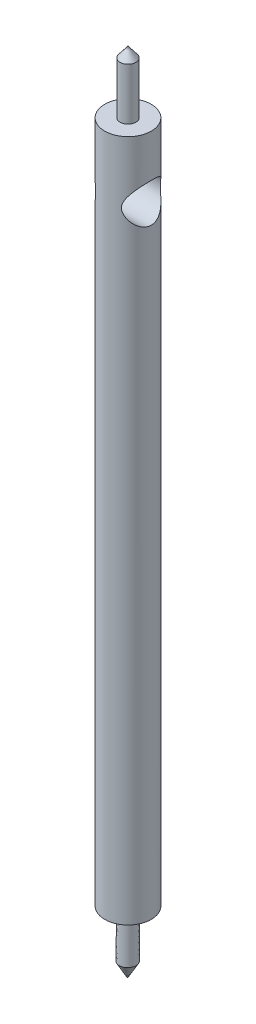
ISO-10303-21;
HEADER;
FILE_DESCRIPTION(('STEP AP214'),'2;1');
FILE_NAME('part.step','',(''),(''),'','','');
FILE_SCHEMA(('AUTOMOTIVE_DESIGN { 1 0 10303 214 1 1 1 1 }'));
ENDSEC;
DATA;
#1=APPLICATION_CONTEXT('core data for automotive mechanical design processes');
#2=APPLICATION_PROTOCOL_DEFINITION('international standard','automotive_design',2000,#1);
#3=PRODUCT_CONTEXT('',#1,'mechanical');
#4=PRODUCT('Part','Part','',(#3));
#5=PRODUCT_RELATED_PRODUCT_CATEGORY('part','',(#4));
#6=PRODUCT_DEFINITION_FORMATION('','',#4);
#7=PRODUCT_DEFINITION_CONTEXT('part definition',#1,'design');
#8=PRODUCT_DEFINITION('design','',#6,#7);
#9=PRODUCT_DEFINITION_SHAPE('','',#8);
#10=(LENGTH_UNIT() NAMED_UNIT(*) SI_UNIT(.MILLI.,.METRE.));
#11=(NAMED_UNIT(*) PLANE_ANGLE_UNIT() SI_UNIT($,.RADIAN.));
#12=(NAMED_UNIT(*) SI_UNIT($,.STERADIAN.) SOLID_ANGLE_UNIT());
#13=UNCERTAINTY_MEASURE_WITH_UNIT(LENGTH_MEASURE(1.E-05),#10,'distance_accuracy_value','');
#14=(GEOMETRIC_REPRESENTATION_CONTEXT(3) GLOBAL_UNCERTAINTY_ASSIGNED_CONTEXT((#13)) GLOBAL_UNIT_ASSIGNED_CONTEXT((#10,
#11,#12)) REPRESENTATION_CONTEXT('',''));
#15=CARTESIAN_POINT('',(0.,0.,0.));
#16=DIRECTION('',(0.,0.,1.));
#17=DIRECTION('',(1.,0.,0.));
#18=AXIS2_PLACEMENT_3D('',#15,#16,#17);
#19=CARTESIAN_POINT('',(0.,69.85,0.));
#20=DIRECTION('',(0.,-1.,0.));
#21=DIRECTION('',(0.,0.,-1.));
#22=AXIS2_PLACEMENT_3D('',#19,#20,#21);
#23=CYLINDRICAL_SURFACE('',#22,2.38125);
#24=CARTESIAN_POINT('',(-2.38125,61.515625,0.));
#25=CARTESIAN_POINT('',(-2.38124619893229,61.5156288877463,-0.0942638022028761));
#26=CARTESIAN_POINT('',(-2.37560376973083,61.522389776898,-0.188556370373829));
#27=CARTESIAN_POINT('',(-2.35355423342117,61.5489328722076,-0.374001062388366));
#28=CARTESIAN_POINT('',(-2.33713915402381,61.5687247219502,-0.465150807766289));
#29=CARTESIAN_POINT('',(-2.29506990552934,61.6198541402747,-0.641215169801087));
#30=CARTESIAN_POINT('',(-2.26947097827265,61.6511227006069,-0.726163488174961));
#31=CARTESIAN_POINT('',(-2.21082607429496,61.7236004837804,-0.888873533757661));
#32=CARTESIAN_POINT('',(-2.17777758169867,61.7648130652591,-0.966632820539168));
#33=CARTESIAN_POINT('',(-2.09291012763805,61.8723817103765,-1.14133602134307));
#34=CARTESIAN_POINT('',(-2.03865540175792,61.9424129402424,-1.23483544681332));
#35=CARTESIAN_POINT('',(-1.92424608851634,62.0954664334671,-1.40653129764619));
#36=CARTESIAN_POINT('',(-1.8640753055365,62.1785247509003,-1.48468385481828));
#37=CARTESIAN_POINT('',(-1.74145298990362,62.3578582267881,-1.62683870846655));
#38=CARTESIAN_POINT('',(-1.67897985642165,62.4543495472282,-1.69055234780284));
#39=CARTESIAN_POINT('',(-1.58949036558562,62.6080536366354,-1.77356817192732));
#40=CARTESIAN_POINT('',(-1.5603838533937,62.6607406227103,-1.79913341035585));
#41=CARTESIAN_POINT('',(-1.50477243717302,62.769306073067,-1.8458937754017));
#42=CARTESIAN_POINT('',(-1.4782653266259,62.82518176572,-1.86709262557574));
#43=CARTESIAN_POINT('',(-1.42709849437255,62.9456996001127,-1.90653636591639));
#44=CARTESIAN_POINT('',(-1.40284450736213,63.0106726093386,-1.92431844202449));
#45=CARTESIAN_POINT('',(-1.36202083394593,63.1443121441375,-1.95342908406319));
#46=CARTESIAN_POINT('',(-1.34543251477101,63.2129692561426,-1.96477331381082));
#47=CARTESIAN_POINT('',(-1.32255363370602,63.3537638910638,-1.98025604077554));
#48=CARTESIAN_POINT('',(-1.31639080528536,63.4259335938844,-1.98430519698593));
#49=CARTESIAN_POINT('',(-1.31618282128052,63.5702965476986,-1.98444301255097));
#50=CARTESIAN_POINT('',(-1.32213782453083,63.6424897989885,-1.98053156756201));
#51=CARTESIAN_POINT('',(-1.34573676405908,63.7901352471539,-1.96457301941577));
#52=CARTESIAN_POINT('',(-1.36431283599325,63.8653581627764,-1.95187551888467));
#53=CARTESIAN_POINT('',(-1.41040037096125,64.0113424642087,-1.91883149406835));
#54=CARTESIAN_POINT('',(-1.43794144320332,64.0820881249965,-1.89845958753228));
#55=CARTESIAN_POINT('',(-1.49226766991751,64.2047127439961,-1.85591664598305));
#56=CARTESIAN_POINT('',(-1.51804938997217,64.2574853425251,-1.83497150973277));
#57=CARTESIAN_POINT('',(-1.57179959848939,64.3601478277706,-1.78914762308032));
#58=CARTESIAN_POINT('',(-1.599769364409,64.4100360004543,-1.76426656595572));
#59=CARTESIAN_POINT('',(-1.6854697693803,64.5556611801379,-1.68393806565736));
#60=CARTESIAN_POINT('',(-1.74496171968918,64.6472974796894,-1.62282714735125));
#61=CARTESIAN_POINT('',(-1.86594668998554,64.8241869014196,-1.48245444634284));
#62=CARTESIAN_POINT('',(-1.92738210387948,64.9088572946385,-1.40241182936482));
#63=CARTESIAN_POINT('',(-2.0439781165019,65.0645704237288,-1.22621983244448));
#64=CARTESIAN_POINT('',(-2.09915214124475,65.13564255133,-1.13010605216819));
#65=CARTESIAN_POINT('',(-2.18621700578689,65.2457855284653,-0.94782623458696));
#66=CARTESIAN_POINT('',(-2.22050252840628,65.2884321752106,-0.86497106086979));
#67=CARTESIAN_POINT('',(-2.28050569471305,65.3624095542721,-0.691412970281286));
#68=CARTESIAN_POINT('',(-2.30622868543829,65.3937473496504,-0.600714995750516));
#69=CARTESIAN_POINT('',(-2.3471968083437,65.4434311912941,-0.412713725727452));
#70=CARTESIAN_POINT('',(-2.36236097582337,65.4616768795173,-0.315365542003585));
#71=CARTESIAN_POINT('',(-2.38038826583451,65.4833504559822,-0.117919484908167));
#72=CARTESIAN_POINT('',(-2.38325961868918,65.4867882584546,-0.017823496456576));
#73=CARTESIAN_POINT('',(-2.37684466587795,65.4790866783778,0.16931498141157));
#74=CARTESIAN_POINT('',(-2.36897342198354,65.4696440441683,0.256484904123788));
#75=CARTESIAN_POINT('',(-2.34414691567293,65.4397131446255,0.427549403153184));
#76=CARTESIAN_POINT('',(-2.32719056358532,65.419223554314,0.511443585281509));
#77=CARTESIAN_POINT('',(-2.28512289146913,65.36799254293,0.675136505622635));
#78=CARTESIAN_POINT('',(-2.25990528629783,65.3371173593348,0.754865256970831));
#79=CARTESIAN_POINT('',(-2.20294368786565,65.2665739810668,0.907778810227216));
#80=CARTESIAN_POINT('',(-2.17119728243496,65.2269025360498,0.980961179088172));
#81=CARTESIAN_POINT('',(-2.08736149380996,65.1204919794032,1.15147566125867));
#82=CARTESIAN_POINT('',(-2.03254053008536,65.0495997092357,1.2448856213835));
#83=CARTESIAN_POINT('',(-1.91710149752061,64.8947580385671,1.4162672126533));
#84=CARTESIAN_POINT('',(-1.85646572792945,64.8107682489345,1.49418933373272));
#85=CARTESIAN_POINT('',(-1.733147360448,64.6294974487967,1.63568040709308));
#86=CARTESIAN_POINT('',(-1.67044756595596,64.5320043850126,1.6989657154687));
#87=CARTESIAN_POINT('',(-1.58096248539379,64.3766892619442,1.78117008068904));
#88=CARTESIAN_POINT('',(-1.55191825518474,64.323455368612,1.80643442108882));
#89=CARTESIAN_POINT('',(-1.49659569911967,64.213752366058,1.85252293626134));
#90=CARTESIAN_POINT('',(-1.47031485002799,64.1572862822079,1.87335117976459));
#91=CARTESIAN_POINT('',(-1.42022178250128,64.036359045241,1.91164685571522));
#92=CARTESIAN_POINT('',(-1.39676757045979,63.9716185430395,1.92871983415567));
#93=CARTESIAN_POINT('',(-1.35765427406801,63.8385728720701,1.9564528155077));
#94=CARTESIAN_POINT('',(-1.34197573933079,63.7702770748934,1.96712883411246));
#95=CARTESIAN_POINT('',(-1.32092158299767,63.6304625508652,1.98133725994912));
#96=CARTESIAN_POINT('',(-1.31566643353356,63.5589158055929,1.98478616254643));
#97=CARTESIAN_POINT('',(-1.31702419641809,63.4159790387771,1.98388443299115));
#98=CARTESIAN_POINT('',(-1.32364023819379,63.344589063528,1.97953174422044));
#99=CARTESIAN_POINT('',(-1.34852488474869,63.1970473850861,1.9626680338222));
#100=CARTESIAN_POINT('',(-1.36795963277772,63.1211984705811,1.94933738766091));
#101=CARTESIAN_POINT('',(-1.41572240352001,62.9741157859252,1.91492457063));
#102=CARTESIAN_POINT('',(-1.44407979315095,62.9028982064876,1.89381676313956));
#103=CARTESIAN_POINT('',(-1.49981141627206,62.7794424480063,1.84984100962238));
#104=CARTESIAN_POINT('',(-1.52620516949777,62.7262971409925,1.8282114586091));
#105=CARTESIAN_POINT('',(-1.58111178275298,62.6229488058905,1.780941851927));
#106=CARTESIAN_POINT('',(-1.60962586975147,62.5727475119345,1.75529946453016));
#107=CARTESIAN_POINT('',(-1.69684645365688,62.4262709106036,1.67256058705098));
#108=CARTESIAN_POINT('',(-1.75720200506494,62.3341821282599,1.60967401541502));
#109=CARTESIAN_POINT('',(-1.87938254236198,62.1569692363792,1.46549822442928));
#110=CARTESIAN_POINT('',(-1.94113463075121,62.0724074510164,1.38345830424524));
#111=CARTESIAN_POINT('',(-2.05784845630328,61.9173706090857,1.20295634232785));
#112=CARTESIAN_POINT('',(-2.11282512218123,61.8468643632467,1.10453157042008));
#113=CARTESIAN_POINT('',(-2.19822955205133,61.7392131064183,0.91960317517569));
#114=CARTESIAN_POINT('',(-2.23132788088647,61.6981569327312,0.836611530983488));
#115=CARTESIAN_POINT('',(-2.28886909433274,61.6273701802806,0.663130330406663));
#116=CARTESIAN_POINT('',(-2.31332350596358,61.5976245144468,0.572650959570417));
#117=CARTESIAN_POINT('',(-2.34837879472141,61.5551629138535,0.402129655174018));
#118=CARTESIAN_POINT('',(-2.36062950220377,61.5404097490195,0.32293358845148));
#119=CARTESIAN_POINT('',(-2.37706632776154,61.5206396179242,0.162498665866098));
#120=CARTESIAN_POINT('',(-2.38125327670682,61.515621648572,0.0812600213393851));
#121=CARTESIAN_POINT('',(-2.38125,61.515625,0.));
#122=B_SPLINE_CURVE_WITH_KNOTS('',3,(#24,#25,#26,#27,#28,#29,#30,#31,#32,#33,#34,#35,#36,#37,
#38,#39,#40,#41,#42,#43,#44,#45,#46,#47,#48,#49,#50,#51,#52,#53,#54,#55,#56,#57,#58,#59,#60,#61,
#62,#63,#64,#65,#66,#67,#68,#69,#70,#71,#72,#73,#74,#75,#76,#77,#78,#79,#80,#81,#82,#83,#84,#85,
#86,#87,#88,#89,#90,#91,#92,#93,#94,#95,#96,#97,#98,#99,#100,#101,#102,#103,#104,#105,#106,#107,
#108,#109,#110,#111,#112,#113,#114,#115,#116,#117,#118,#119,#120,#121),.UNSPECIFIED.,.T.,.F.,(4,
2,2,2,2,2,2,2,2,2,2,2,2,2,2,2,2,2,2,2,2,2,2,2,2,2,2,2,2,2,2,2,2,2,2,2,2,2,2,2,2,2,2,2,2,2,2,2,
4),(0.,0.282449013471996,0.565107289127649,0.84609309254143,1.12717393333904,1.5114998564085,
1.8969088547394,2.28945085048732,2.48543247443763,2.68124627136493,2.8954052391685,
3.10904088140611,3.32527552885171,3.54151301061159,3.77575839784502,4.01078542639973,
4.19760996917678,4.38454441252948,4.75862580567162,5.15223032698661,5.54497424247985,
5.84172003742298,6.13828017457599,6.43708999986,6.73569973374995,6.99854164364075,
7.26141508595182,7.52781285038135,7.79430921712741,8.18053774346967,8.5679817442033,
8.96240064241102,9.15926678879395,9.35595158703392,9.56814374290223,9.77980240150175,
9.99389345037003,10.2080409451956,10.44499903866,10.6827453325745,10.8719706596274,
11.0613063504118,11.4401839920795,11.8376254543405,12.2341749284842,12.5280472850716,
12.821526259001,13.0650362553546,13.3085211596939),.UNSPECIFIED.);
#123=CARTESIAN_POINT('',(-2.38125,61.515625,0.));
#124=VERTEX_POINT('',#123);
#125=EDGE_CURVE('E11',#124,#124,#122,.T.);
#126=ORIENTED_EDGE('',*,*,#125,.T.);
#127=EDGE_LOOP('',(#126));
#128=FACE_BOUND('',#127,.T.);
#129=CARTESIAN_POINT('',(1.3162854636723,63.5,-1.984375));
#130=CARTESIAN_POINT('',(1.31629823438237,63.4299083698847,-1.98437009445767));
#131=CARTESIAN_POINT('',(1.32200734804397,63.3596969186257,-1.98061473685907));
#132=CARTESIAN_POINT('',(1.34365704401092,63.2215700558854,-1.96598373364511));
#133=CARTESIAN_POINT('',(1.35963278065874,63.1536633806295,-1.95508362082444));
#134=CARTESIAN_POINT('',(1.40678785560517,62.995885159151,-1.9215644206423));
#135=CARTESIAN_POINT('',(1.44146079163519,62.9077103741108,-1.8960397224068));
#136=CARTESIAN_POINT('',(1.51873558968643,62.7386526082338,-1.83473012605878));
#137=CARTESIAN_POINT('',(1.56136294823384,62.6577943528387,-1.79891202905429));
#138=CARTESIAN_POINT('',(1.63775453768597,62.5244450438547,-1.7291640178252));
#139=CARTESIAN_POINT('',(1.6707047499674,62.4702986118554,-1.69745735580534));
#140=CARTESIAN_POINT('',(1.73725399065927,62.3655033640659,-1.62928631935872));
#141=CARTESIAN_POINT('',(1.77085329252038,62.3148560654167,-1.59281990076796));
#142=CARTESIAN_POINT('',(1.87108614338897,62.1682805657103,-1.47642403160194));
#143=CARTESIAN_POINT('',(1.93729317643582,62.0774915480125,-1.3893785896546));
#144=CARTESIAN_POINT('',(2.04873514251758,61.9294910079061,-1.21706668650598));
#145=CARTESIAN_POINT('',(2.09543974740632,61.8692420358275,-1.13533922898676));
#146=CARTESIAN_POINT('',(2.18103283537921,61.7606262106947,-0.960654245320355));
#147=CARTESIAN_POINT('',(2.21993395928619,61.7122401123009,-0.867715278281164));
#148=CARTESIAN_POINT('',(2.28102258258678,61.6369791633486,-0.688919893196209));
#149=CARTESIAN_POINT('',(2.30493673767611,61.6078317905546,-0.604615693680801));
#150=CARTESIAN_POINT('',(2.34362928701727,61.5608842998115,-0.430874618476056));
#151=CARTESIAN_POINT('',(2.3584129461427,61.5430776423355,-0.34144073327024));
#152=CARTESIAN_POINT('',(2.37767145907066,61.5199100628315,-0.159469294400446));
#153=CARTESIAN_POINT('',(2.38210319359148,61.5146011976379,-0.0669203819757578));
#154=CARTESIAN_POINT('',(2.38012401426685,61.5169761570603,0.117893618718447));
#155=CARTESIAN_POINT('',(2.37371334061986,61.5246596938477,0.21015871323019));
#156=CARTESIAN_POINT('',(2.35141560428859,61.5515138105753,0.385322787362306));
#157=CARTESIAN_POINT('',(2.3361935314721,61.5698786997901,0.468434741892943));
#158=CARTESIAN_POINT('',(2.29791666684876,61.6163898410408,0.629940841377827));
#159=CARTESIAN_POINT('',(2.27486075144444,61.6445374962188,0.708334307665974));
#160=CARTESIAN_POINT('',(2.22004179958663,61.7121504923393,0.865611081793804));
#161=CARTESIAN_POINT('',(2.18770249151737,61.7523782167739,0.943962225988951));
#162=CARTESIAN_POINT('',(2.11728655256108,61.841377375019,1.09281847392295));
#163=CARTESIAN_POINT('',(2.07920476932005,61.8901564878962,1.16331643172284));
#164=CARTESIAN_POINT('',(1.97999976579373,62.0200208388002,1.32778802640829));
#165=CARTESIAN_POINT('',(1.91653147186304,62.1054377835663,1.41698200165033));
#166=CARTESIAN_POINT('',(1.81930631636563,62.2436844902893,1.53725711423942));
#167=CARTESIAN_POINT('',(1.78651401568514,62.2915268711021,1.57513920442177));
#168=CARTESIAN_POINT('',(1.72107523439194,62.3905532297237,1.6463858859969));
#169=CARTESIAN_POINT('',(1.68842870545569,62.4417359961966,1.67975210165348));
#170=CARTESIAN_POINT('',(1.60921711050668,62.5722003923462,1.75643248792447));
#171=CARTESIAN_POINT('',(1.56327619192922,62.6534367322543,1.79711010196465));
#172=CARTESIAN_POINT('',(1.47807246346079,62.8236148047046,1.86780527263254));
#173=CARTESIAN_POINT('',(1.43879087248323,62.9125337621374,1.89785307771811));
#174=CARTESIAN_POINT('',(1.38411432335458,63.0680574846981,1.9378698980332));
#175=CARTESIAN_POINT('',(1.36510672238184,63.1324927596751,1.95119115481508));
#176=CARTESIAN_POINT('',(1.33570399598543,63.2642254077455,1.97143904431868));
#177=CARTESIAN_POINT('',(1.32528862410468,63.331515657422,1.9783807141285));
#178=CARTESIAN_POINT('',(1.31492077433465,63.4677957481468,1.98529191696904));
#179=CARTESIAN_POINT('',(1.31504384506415,63.5367943155477,1.98521110676302));
#180=CARTESIAN_POINT('',(1.32592082400651,63.6735976167771,1.97795831193015));
#181=CARTESIAN_POINT('',(1.33668945218911,63.7414005652478,1.9707765085191));
#182=CARTESIAN_POINT('',(1.37064660522762,63.8906715191352,1.94735482592436));
#183=CARTESIAN_POINT('',(1.39628372202793,63.9712696362222,1.92928634004855));
#184=CARTESIAN_POINT('',(1.45610494269744,64.1267703103853,1.8845418012558));
#185=CARTESIAN_POINT('',(1.49031720727045,64.2016530197603,1.85783730219419));
#186=CARTESIAN_POINT('',(1.55549937229455,64.330259671784,1.80337937489322));
#187=CARTESIAN_POINT('',(1.58558561754945,64.3850719682581,1.77708511867602));
#188=CARTESIAN_POINT('',(1.64731116560229,64.4914119550398,1.72002578186679));
#189=CARTESIAN_POINT('',(1.67895126469816,64.542937929462,1.68925839277311));
#190=CARTESIAN_POINT('',(1.77467393149896,64.6928242459191,1.59036869408104));
#191=CARTESIAN_POINT('',(1.83954159599311,64.786461494673,1.51567239847829));
#192=CARTESIAN_POINT('',(1.96665613502255,64.9624856861622,1.34689202507275));
#193=CARTESIAN_POINT('',(2.02879442889168,65.0445260202904,1.25236326033432));
#194=CARTESIAN_POINT('',(2.14270591005696,65.1913641898598,1.04546002706566));
#195=CARTESIAN_POINT('',(2.19451363499665,65.2562197259104,0.933147353830186));
#196=CARTESIAN_POINT('',(2.26730957256611,65.3462183204202,0.732781584002219));
#197=CARTESIAN_POINT('',(2.29281867137313,65.3773965941014,0.649064193424866));
#198=CARTESIAN_POINT('',(2.33486064645317,65.4285180365279,0.476098204743567));
#199=CARTESIAN_POINT('',(2.35140050948744,65.448469950722,0.38685397243937));
#200=CARTESIAN_POINT('',(2.3742168844758,65.4759446640546,0.204708909971645));
#201=CARTESIAN_POINT('',(2.38044397613531,65.4834076160532,0.111792644779052));
#202=CARTESIAN_POINT('',(2.38190808751346,65.4851648591009,-0.0742550283426369));
#203=CARTESIAN_POINT('',(2.37714590985478,65.4794601118785,-0.16738642006324));
#204=CARTESIAN_POINT('',(2.3578152376613,65.4562009400255,-0.3440740692035));
#205=CARTESIAN_POINT('',(2.34398584292428,65.4395393592388,-0.427833829668275));
#206=CARTESIAN_POINT('',(2.30828084656887,65.396233791326,-0.590901122066229));
#207=CARTESIAN_POINT('',(2.28640398669529,65.3695882431522,-0.670207955529183));
#208=CARTESIAN_POINT('',(2.23412382539294,65.3052918872487,-0.828547866796456));
#209=CARTESIAN_POINT('',(2.20321735172468,65.2669832599041,-0.907144250729618));
#210=CARTESIAN_POINT('',(2.13550114406577,65.1817916665288,-1.05676208286547));
#211=CARTESIAN_POINT('',(2.0986868612981,65.1349020895726,-1.1277776233896));
#212=CARTESIAN_POINT('',(2.00236480718272,65.0096883611902,-1.29382036776765));
#213=CARTESIAN_POINT('',(1.94040147502379,64.9270310787053,-1.38416798980358));
#214=CARTESIAN_POINT('',(1.81286526312428,64.748147753169,-1.54745187183407));
#215=CARTESIAN_POINT('',(1.74728503042312,64.651893397953,-1.62035092421525));
#216=CARTESIAN_POINT('',(1.63313219581337,64.4687429174916,-1.73443229652641));
#217=CARTESIAN_POINT('',(1.58395869838321,64.3843532533091,-1.77906441372951));
#218=CARTESIAN_POINT('',(1.49223289629784,64.2070376571265,-1.85665445465093));
#219=CARTESIAN_POINT('',(1.44966273957458,64.1141358602579,-1.88964417305725));
#220=CARTESIAN_POINT('',(1.39062680064825,63.9525359933203,-1.93323014476181));
#221=CARTESIAN_POINT('',(1.37020594884767,63.8863385851203,-1.94762657244299));
#222=CARTESIAN_POINT('',(1.33836912961915,63.7508032201115,-1.96964635539582));
#223=CARTESIAN_POINT('',(1.32691854607342,63.6814784388283,-1.97729576185517));
#224=CARTESIAN_POINT('',(1.31943758973221,63.5930343752869,-1.98228078036403));
#225=CARTESIAN_POINT('',(1.31825910099148,63.5744594422931,-1.98306473124747));
#226=CARTESIAN_POINT('',(1.31668126770801,63.5372591681949,-1.98411254166871));
#227=CARTESIAN_POINT('',(1.3162820685866,63.5186338183315,-1.98437630413552));
#228=CARTESIAN_POINT('',(1.3162854636723,63.5,-1.984375));
#229=B_SPLINE_CURVE_WITH_KNOTS('',3,(#129,#130,#131,#132,#133,#134,#135,#136,#137,#138,#139,
#140,#141,#142,#143,#144,#145,#146,#147,#148,#149,#150,#151,#152,#153,#154,#155,#156,#157,#158,
#159,#160,#161,#162,#163,#164,#165,#166,#167,#168,#169,#170,#171,#172,#173,#174,#175,#176,#177,
#178,#179,#180,#181,#182,#183,#184,#185,#186,#187,#188,#189,#190,#191,#192,#193,#194,#195,#196,
#197,#198,#199,#200,#201,#202,#203,#204,#205,#206,#207,#208,#209,#210,#211,#212,#213,#214,#215,
#216,#217,#218,#219,#220,#221,#222,#223,#224,#225,#226,#227,#228),.UNSPECIFIED.,.T.,.F.,(4,2,2,
2,2,2,2,2,2,2,2,2,2,2,2,2,2,2,2,2,2,2,2,2,2,2,2,2,2,2,2,2,2,2,2,2,2,2,2,2,2,2,2,2,2,2,2,2,2,4),
(0.,0.210190942682388,0.421105471175682,0.713828670696644,1.00750678315276,1.21986890810363,
1.43232253777737,1.856364820032,2.19046214144847,2.52401381033041,2.79991522550439,
3.07565740008507,3.35254610203762,3.62942866998714,3.88772543500892,4.14605926283631,
4.42650001120155,4.70719389490841,5.12137537897287,5.32904179631495,5.53663332083894,
5.84122336202198,6.14493954672999,6.34969566946922,6.55396792198393,6.75970469540782,
6.96572634644671,7.22374295562898,7.48261825261597,7.68585112891595,7.88918926475314,
8.29597936411298,8.71311310758292,9.12882798379171,9.40644018515772,9.68383582330314,
9.96255697518922,10.2412577707776,10.4996701796844,10.7581230096489,11.0353134511924,
11.3127183514536,11.722286997754,12.1327213854146,12.4540323361566,12.7744588893367,
12.9860187278511,13.1967580827146,13.2526267957456,13.3085059333033),.UNSPECIFIED.);
#230=CARTESIAN_POINT('',(1.3162854636723,63.5,-1.984375));
#231=VERTEX_POINT('',#230);
#232=EDGE_CURVE('E43',#231,#231,#229,.T.);
#233=ORIENTED_EDGE('',*,*,#232,.T.);
#234=EDGE_LOOP('',(#233));
#235=FACE_BOUND('',#234,.T.);
#236=CARTESIAN_POINT('',(0.,69.85,0.));
#237=DIRECTION('',(0.,1.,0.));
#238=DIRECTION('',(0.,0.,1.));
#239=AXIS2_PLACEMENT_3D('',#236,#237,#238);
#240=CIRCLE('',#239,2.38125);
#241=CARTESIAN_POINT('',(0.,69.85,2.38125));
#242=VERTEX_POINT('',#241);
#243=EDGE_CURVE('E82',#242,#242,#240,.T.);
#244=ORIENTED_EDGE('',*,*,#243,.F.);
#245=EDGE_LOOP('',(#244));
#246=FACE_BOUND('',#245,.T.);
#247=CARTESIAN_POINT('',(0.,0.,0.));
#248=DIRECTION('',(0.,1.,0.));
#249=DIRECTION('',(0.,0.,1.));
#250=AXIS2_PLACEMENT_3D('',#247,#248,#249);
#251=CIRCLE('',#250,2.38125);
#252=CARTESIAN_POINT('',(0.,0.,2.38125));
#253=VERTEX_POINT('',#252);
#254=EDGE_CURVE('E85',#253,#253,#251,.T.);
#255=ORIENTED_EDGE('',*,*,#254,.T.);
#256=EDGE_LOOP('',(#255));
#257=FACE_BOUND('',#256,.T.);
#258=ADVANCED_FACE('F32',(#128,#235,#246,#257),#23,.T.);
#259=CARTESIAN_POINT('',(0.,69.85,0.));
#260=DIRECTION('',(0.,1.,0.));
#261=DIRECTION('',(0.,0.,1.));
#262=AXIS2_PLACEMENT_3D('',#259,#260,#261);
#263=PLANE('',#262);
#264=CARTESIAN_POINT('',(0.,69.85,0.));
#265=DIRECTION('',(0.,1.,0.));
#266=DIRECTION('',(0.,0.,1.));
#267=AXIS2_PLACEMENT_3D('',#264,#265,#266);
#268=CIRCLE('',#267,0.8128);
#269=CARTESIAN_POINT('',(0.,69.85,0.8128));
#270=VERTEX_POINT('',#269);
#271=EDGE_CURVE('E92',#270,#270,#268,.T.);
#272=ORIENTED_EDGE('',*,*,#271,.F.);
#273=EDGE_LOOP('',(#272));
#274=FACE_BOUND('',#273,.T.);
#275=ORIENTED_EDGE('',*,*,#243,.T.);
#276=EDGE_LOOP('',(#275));
#277=FACE_BOUND('',#276,.T.);
#278=ADVANCED_FACE('F66',(#274,#277),#263,.T.);
#279=CARTESIAN_POINT('',(0.,0.,0.));
#280=DIRECTION('',(0.,1.,0.));
#281=DIRECTION('',(0.,0.,1.));
#282=AXIS2_PLACEMENT_3D('',#279,#280,#281);
#283=PLANE('',#282);
#284=CARTESIAN_POINT('',(0.,0.,5.89139558970734E-05));
#285=DIRECTION('',(0.,1.,0.));
#286=DIRECTION('',(0.,0.,1.));
#287=AXIS2_PLACEMENT_3D('',#284,#285,#286);
#288=ELLIPSE('',#287,0.812858913955897,0.812829456444187);
#289=CARTESIAN_POINT('',(0.,0.,0.812917827911794));
#290=VERTEX_POINT('',#289);
#291=EDGE_CURVE('E89',#290,#290,#288,.F.);
#292=ORIENTED_EDGE('',*,*,#291,.F.);
#293=EDGE_LOOP('',(#292));
#294=FACE_BOUND('',#293,.T.);
#295=ORIENTED_EDGE('',*,*,#254,.F.);
#296=EDGE_LOOP('',(#295));
#297=FACE_BOUND('',#296,.T.);
#298=ADVANCED_FACE('F71',(#294,#297),#283,.F.);
#299=CARTESIAN_POINT('',(0.,75.1577535694582,0.));
#300=DIRECTION('',(0.,-1.,0.));
#301=DIRECTION('',(0.,0.,-1.));
#302=AXIS2_PLACEMENT_3D('',#299,#300,#301);
#303=CONICAL_SURFACE('',#302,0.812799999999999,0.662335485421964);
#304=CARTESIAN_POINT('',(0.,76.2,0.));
#305=VERTEX_POINT('',#304);
#306=VERTEX_LOOP('',#305);
#307=FACE_BOUND('',#306,.T.);
#308=CARTESIAN_POINT('',(0.,75.1577535694582,0.));
#309=DIRECTION('',(0.,1.,0.));
#310=DIRECTION('',(0.,0.,1.));
#311=AXIS2_PLACEMENT_3D('',#308,#309,#310);
#312=CIRCLE('',#311,0.812799999999999);
#313=CARTESIAN_POINT('',(0.,75.1577535694582,0.812799999999999));
#314=VERTEX_POINT('',#313);
#315=EDGE_CURVE('E87',#314,#314,#312,.T.);
#316=ORIENTED_EDGE('',*,*,#315,.T.);
#317=EDGE_LOOP('',(#316));
#318=FACE_BOUND('',#317,.T.);
#319=ADVANCED_FACE('F104',(#307,#318),#303,.T.);
#320=CARTESIAN_POINT('',(0.,79.2439773138744,0.));
#321=DIRECTION('',(0.,1.,0.));
#322=DIRECTION('',(0.,0.,1.));
#323=AXIS2_PLACEMENT_3D('',#320,#321,#322);
#324=CYLINDRICAL_SURFACE('',#323,0.8128);
#325=ORIENTED_EDGE('',*,*,#315,.F.);
#326=EDGE_LOOP('',(#325));
#327=FACE_BOUND('',#326,.T.);
#328=ORIENTED_EDGE('',*,*,#271,.T.);
#329=EDGE_LOOP('',(#328));
#330=FACE_BOUND('',#329,.T.);
#331=ADVANCED_FACE('F60',(#327,#330),#324,.T.);
#332=CARTESIAN_POINT('',(0.,-4.84128406042421,0.0412156422566033));
#333=DIRECTION('',(0.,-0.999963763235767,0.00851306145656753));
#334=DIRECTION('',(0.,-0.00851306145656753,-0.999963763235767));
#335=AXIS2_PLACEMENT_3D('',#332,#333,#334);
#336=CONICAL_SURFACE('',#335,0.854046590141534,0.00851316428665832);
#337=CARTESIAN_POINT('',(0.,-4.84128406042421,0.0412156422566033));
#338=DIRECTION('',(0.,0.999963763235767,-0.00851306145656753));
#339=DIRECTION('',(0.,0.00851306145656753,0.999963763235767));
#340=AXIS2_PLACEMENT_3D('',#337,#338,#339);
#341=CIRCLE('',#340,0.854046590141534);
#342=CARTESIAN_POINT('',(0.,-4.83401350931556,0.895231284513207));
#343=VERTEX_POINT('',#342);
#344=EDGE_CURVE('E117',#343,#343,#341,.T.);
#345=ORIENTED_EDGE('',*,*,#344,.T.);
#346=EDGE_LOOP('',(#345));
#347=FACE_BOUND('',#346,.T.);
#348=ORIENTED_EDGE('',*,*,#291,.T.);
#349=EDGE_LOOP('',(#348));
#350=FACE_BOUND('',#349,.T.);
#351=ADVANCED_FACE('F52',(#347,#350),#336,.T.);
#352=CARTESIAN_POINT('',(0.,-6.35,0.0540598992050258));
#353=DIRECTION('',(0.,0.999963763235767,-0.00851306145656753));
#354=DIRECTION('',(0.,0.00851306145656753,0.999963763235767));
#355=AXIS2_PLACEMENT_3D('',#352,#353,#354);
#356=CONICAL_SURFACE('',#355,0.,0.51508561131164);
#357=ORIENTED_EDGE('',*,*,#344,.F.);
#358=EDGE_LOOP('',(#357));
#359=FACE_BOUND('',#358,.T.);
#360=CARTESIAN_POINT('',(0.,-6.35,0.0540598992050258));
#361=VERTEX_POINT('',#360);
#362=VERTEX_LOOP('',#361);
#363=FACE_BOUND('',#362,.T.);
#364=ADVANCED_FACE('F49',(#359,#363),#356,.T.);
#365=CARTESIAN_POINT('',(-2.38125,63.5,0.));
#366=DIRECTION('',(1.,0.,0.));
#367=DIRECTION('',(0.,0.,-1.));
#368=AXIS2_PLACEMENT_3D('',#365,#366,#367);
#369=CYLINDRICAL_SURFACE('',#368,1.984375);
#370=ORIENTED_EDGE('',*,*,#232,.F.);
#371=EDGE_LOOP('',(#370));
#372=FACE_BOUND('',#371,.T.);
#373=ORIENTED_EDGE('',*,*,#125,.F.);
#374=EDGE_LOOP('',(#373));
#375=FACE_BOUND('',#374,.T.);
#376=ADVANCED_FACE('F51',(#372,#375),#369,.F.);
#377=CLOSED_SHELL('',(#258,#278,#298,#319,#331,#351,#364,#376));
#378=MANIFOLD_SOLID_BREP('B2',#377);
#379=ADVANCED_BREP_SHAPE_REPRESENTATION('',(#18,#378),#14);
#380=SHAPE_DEFINITION_REPRESENTATION(#9,#379);
ENDSEC;
END-ISO-10303-21;
